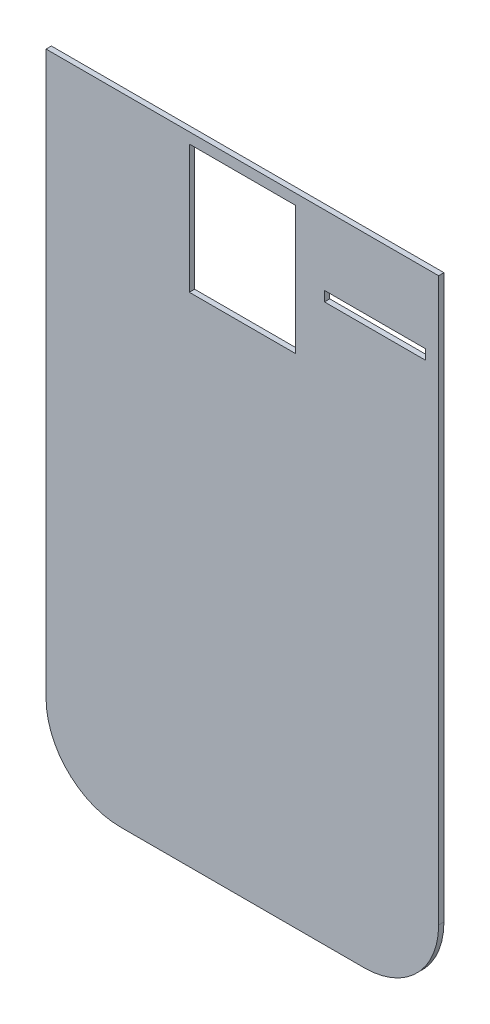
ISO-10303-21;
HEADER;
FILE_DESCRIPTION(('STEP AP214'),'2;1');
FILE_NAME('part.step','',(''),(''),'','','');
FILE_SCHEMA(('AUTOMOTIVE_DESIGN { 1 0 10303 214 1 1 1 1 }'));
ENDSEC;
DATA;
#1=APPLICATION_CONTEXT('core data for automotive mechanical design processes');
#2=APPLICATION_PROTOCOL_DEFINITION('international standard','automotive_design',2000,#1);
#3=PRODUCT_CONTEXT('',#1,'mechanical');
#4=PRODUCT('Part','Part','',(#3));
#5=PRODUCT_RELATED_PRODUCT_CATEGORY('part','',(#4));
#6=PRODUCT_DEFINITION_FORMATION('','',#4);
#7=PRODUCT_DEFINITION_CONTEXT('part definition',#1,'design');
#8=PRODUCT_DEFINITION('design','',#6,#7);
#9=PRODUCT_DEFINITION_SHAPE('','',#8);
#10=(LENGTH_UNIT() NAMED_UNIT(*) SI_UNIT(.MILLI.,.METRE.));
#11=(NAMED_UNIT(*) PLANE_ANGLE_UNIT() SI_UNIT($,.RADIAN.));
#12=(NAMED_UNIT(*) SI_UNIT($,.STERADIAN.) SOLID_ANGLE_UNIT());
#13=UNCERTAINTY_MEASURE_WITH_UNIT(LENGTH_MEASURE(1.E-05),#10,'distance_accuracy_value','');
#14=(GEOMETRIC_REPRESENTATION_CONTEXT(3) GLOBAL_UNCERTAINTY_ASSIGNED_CONTEXT((#13)) GLOBAL_UNIT_ASSIGNED_CONTEXT((#10,
#11,#12)) REPRESENTATION_CONTEXT('',''));
#15=CARTESIAN_POINT('',(0.,0.,0.));
#16=DIRECTION('',(0.,0.,1.));
#17=DIRECTION('',(1.,0.,0.));
#18=AXIS2_PLACEMENT_3D('',#15,#16,#17);
#19=CARTESIAN_POINT('',(400.,0.,350.));
#20=DIRECTION('',(0.,0.,-1.));
#21=DIRECTION('',(0.,1.,0.));
#22=AXIS2_PLACEMENT_3D('',#19,#20,#21);
#23=PLANE('',#22);
#24=DIRECTION('',(-1.,0.,0.));
#25=VECTOR('',#24,1.);
#26=CARTESIAN_POINT('',(372.65,794.2,350.));
#27=LINE('',#26,#25);
#28=CARTESIAN_POINT('',(372.65,794.2,350.));
#29=VERTEX_POINT('',#28);
#30=CARTESIAN_POINT('',(277.35,794.2,350.));
#31=VERTEX_POINT('',#30);
#32=EDGE_CURVE('E195',#29,#31,#27,.T.);
#33=ORIENTED_EDGE('',*,*,#32,.F.);
#34=DIRECTION('',(0.,1.,0.));
#35=VECTOR('',#34,1.);
#36=CARTESIAN_POINT('',(372.65,794.2,350.));
#37=LINE('',#36,#35);
#38=CARTESIAN_POINT('',(372.65,784.8,350.));
#39=VERTEX_POINT('',#38);
#40=EDGE_CURVE('E192',#39,#29,#37,.T.);
#41=ORIENTED_EDGE('',*,*,#40,.F.);
#42=DIRECTION('',(1.,0.,0.));
#43=VECTOR('',#42,1.);
#44=CARTESIAN_POINT('',(372.65,784.8,350.));
#45=LINE('',#44,#43);
#46=CARTESIAN_POINT('',(277.35,784.800000000001,350.));
#47=VERTEX_POINT('',#46);
#48=EDGE_CURVE('E201',#47,#39,#45,.T.);
#49=ORIENTED_EDGE('',*,*,#48,.F.);
#50=DIRECTION('',(0.,-1.,0.));
#51=VECTOR('',#50,1.);
#52=CARTESIAN_POINT('',(277.35,794.2,350.));
#53=LINE('',#52,#51);
#54=EDGE_CURVE('E198',#31,#47,#53,.T.);
#55=ORIENTED_EDGE('',*,*,#54,.F.);
#56=EDGE_LOOP('',(#33,#41,#49,#55));
#57=FACE_BOUND('',#56,.T.);
#58=DIRECTION('',(1.,0.,0.));
#59=VECTOR('',#58,1.);
#60=CARTESIAN_POINT('',(150.,729.,350.));
#61=LINE('',#60,#59);
#62=CARTESIAN_POINT('',(150.,729.,350.));
#63=VERTEX_POINT('',#62);
#64=CARTESIAN_POINT('',(250.,729.,350.));
#65=VERTEX_POINT('',#64);
#66=EDGE_CURVE('E215',#63,#65,#61,.T.);
#67=ORIENTED_EDGE('',*,*,#66,.F.);
#68=DIRECTION('',(0.,-1.,0.));
#69=VECTOR('',#68,1.);
#70=CARTESIAN_POINT('',(150.,850.,350.));
#71=LINE('',#70,#69);
#72=CARTESIAN_POINT('',(150.,850.,350.));
#73=VERTEX_POINT('',#72);
#74=EDGE_CURVE('E207',#73,#63,#71,.T.);
#75=ORIENTED_EDGE('',*,*,#74,.F.);
#76=DIRECTION('',(-1.,0.,0.));
#77=VECTOR('',#76,1.);
#78=CARTESIAN_POINT('',(150.,850.,350.));
#79=LINE('',#78,#77);
#80=CARTESIAN_POINT('',(250.,850.,350.));
#81=VERTEX_POINT('',#80);
#82=EDGE_CURVE('E221',#81,#73,#79,.T.);
#83=ORIENTED_EDGE('',*,*,#82,.F.);
#84=DIRECTION('',(0.,1.,0.));
#85=VECTOR('',#84,1.);
#86=CARTESIAN_POINT('',(250.,850.,350.));
#87=LINE('',#86,#85);
#88=EDGE_CURVE('E218',#65,#81,#87,.T.);
#89=ORIENTED_EDGE('',*,*,#88,.F.);
#90=EDGE_LOOP('',(#67,#75,#83,#89));
#91=FACE_BOUND('',#90,.T.);
#92=DIRECTION('',(-1.,0.,0.));
#93=VECTOR('',#92,1.);
#94=CARTESIAN_POINT('',(400.,860.,350.));
#95=LINE('',#94,#93);
#96=CARTESIAN_POINT('',(385.,860.,350.));
#97=VERTEX_POINT('',#96);
#98=CARTESIAN_POINT('',(15.,860.,350.));
#99=VERTEX_POINT('',#98);
#100=EDGE_CURVE('E227',#97,#99,#95,.T.);
#101=ORIENTED_EDGE('',*,*,#100,.T.);
#102=DIRECTION('',(0.,1.,0.));
#103=VECTOR('',#102,1.);
#104=CARTESIAN_POINT('',(15.,917.971493867901,350.));
#105=LINE('',#104,#103);
#106=CARTESIAN_POINT('',(15.,330.,350.));
#107=VERTEX_POINT('',#106);
#108=EDGE_CURVE('E141',#107,#99,#105,.T.);
#109=ORIENTED_EDGE('',*,*,#108,.F.);
#110=CARTESIAN_POINT('',(85.,330.,350.));
#111=DIRECTION('',(0.,0.,-1.));
#112=DIRECTION('',(1.,0.,0.));
#113=AXIS2_PLACEMENT_3D('',#110,#111,#112);
#114=CIRCLE('',#113,70.);
#115=CARTESIAN_POINT('',(85.,260.,350.));
#116=VERTEX_POINT('',#115);
#117=EDGE_CURVE('E156',#116,#107,#114,.T.);
#118=ORIENTED_EDGE('',*,*,#117,.F.);
#119=DIRECTION('',(-1.,0.,0.));
#120=VECTOR('',#119,1.);
#121=CARTESIAN_POINT('',(85.,260.,350.));
#122=LINE('',#121,#120);
#123=CARTESIAN_POINT('',(315.,260.,350.));
#124=VERTEX_POINT('',#123);
#125=EDGE_CURVE('E154',#124,#116,#122,.T.);
#126=ORIENTED_EDGE('',*,*,#125,.F.);
#127=CARTESIAN_POINT('',(315.,330.,350.));
#128=DIRECTION('',(0.,0.,-1.));
#129=DIRECTION('',(1.,0.,0.));
#130=AXIS2_PLACEMENT_3D('',#127,#128,#129);
#131=CIRCLE('',#130,70.);
#132=CARTESIAN_POINT('',(385.,330.,350.));
#133=VERTEX_POINT('',#132);
#134=EDGE_CURVE('E135',#133,#124,#131,.T.);
#135=ORIENTED_EDGE('',*,*,#134,.F.);
#136=DIRECTION('',(0.,-1.,0.));
#137=VECTOR('',#136,1.);
#138=CARTESIAN_POINT('',(385.,330.,350.));
#139=LINE('',#138,#137);
#140=EDGE_CURVE('E144',#97,#133,#139,.T.);
#141=ORIENTED_EDGE('',*,*,#140,.F.);
#142=EDGE_LOOP('',(#101,#109,#118,#126,#135,#141));
#143=FACE_BOUND('',#142,.T.);
#144=ADVANCED_FACE('F33',(#57,#91,#143),#23,.F.);
#145=CARTESIAN_POINT('',(150.,850.,81.9999999999999));
#146=DIRECTION('',(-1.,0.,0.));
#147=DIRECTION('',(0.,-1.,0.));
#148=AXIS2_PLACEMENT_3D('',#145,#146,#147);
#149=PLANE('',#148);
#150=DIRECTION('',(0.,0.,1.));
#151=VECTOR('',#150,1.);
#152=CARTESIAN_POINT('',(150.,729.,81.9999999999999));
#153=LINE('',#152,#151);
#154=CARTESIAN_POINT('',(150.,729.,345.));
#155=VERTEX_POINT('',#154);
#156=EDGE_CURVE('E224',#155,#63,#153,.T.);
#157=ORIENTED_EDGE('',*,*,#156,.F.);
#158=DIRECTION('',(0.,1.,0.));
#159=VECTOR('',#158,1.);
#160=CARTESIAN_POINT('',(150.,850.,345.));
#161=LINE('',#160,#159);
#162=CARTESIAN_POINT('',(150.,850.,345.));
#163=VERTEX_POINT('',#162);
#164=EDGE_CURVE('E55',#155,#163,#161,.T.);
#165=ORIENTED_EDGE('',*,*,#164,.T.);
#166=DIRECTION('',(0.,0.,1.));
#167=VECTOR('',#166,1.);
#168=CARTESIAN_POINT('',(150.,850.,81.9999999999999));
#169=LINE('',#168,#167);
#170=EDGE_CURVE('E225',#163,#73,#169,.T.);
#171=ORIENTED_EDGE('',*,*,#170,.T.);
#172=ORIENTED_EDGE('',*,*,#74,.T.);
#173=EDGE_LOOP('',(#157,#165,#171,#172));
#174=FACE_BOUND('',#173,.T.);
#175=ADVANCED_FACE('F271',(#174),#149,.F.);
#176=CARTESIAN_POINT('',(150.,850.,81.9999999999999));
#177=DIRECTION('',(0.,1.,0.));
#178=DIRECTION('',(0.,0.,1.));
#179=AXIS2_PLACEMENT_3D('',#176,#177,#178);
#180=PLANE('',#179);
#181=ORIENTED_EDGE('',*,*,#170,.F.);
#182=DIRECTION('',(1.,0.,0.));
#183=VECTOR('',#182,1.);
#184=CARTESIAN_POINT('',(150.,850.,345.));
#185=LINE('',#184,#183);
#186=CARTESIAN_POINT('',(250.,850.,345.));
#187=VERTEX_POINT('',#186);
#188=EDGE_CURVE('E188',#163,#187,#185,.T.);
#189=ORIENTED_EDGE('',*,*,#188,.T.);
#190=DIRECTION('',(0.,0.,1.));
#191=VECTOR('',#190,1.);
#192=CARTESIAN_POINT('',(250.,850.,81.9999999999999));
#193=LINE('',#192,#191);
#194=EDGE_CURVE('E228',#187,#81,#193,.T.);
#195=ORIENTED_EDGE('',*,*,#194,.T.);
#196=ORIENTED_EDGE('',*,*,#82,.T.);
#197=EDGE_LOOP('',(#181,#189,#195,#196));
#198=FACE_BOUND('',#197,.T.);
#199=ADVANCED_FACE('F276',(#198),#180,.F.);
#200=CARTESIAN_POINT('',(250.,850.,81.9999999999999));
#201=DIRECTION('',(1.,0.,0.));
#202=DIRECTION('',(0.,0.,-1.));
#203=AXIS2_PLACEMENT_3D('',#200,#201,#202);
#204=PLANE('',#203);
#205=ORIENTED_EDGE('',*,*,#194,.F.);
#206=DIRECTION('',(0.,-1.,0.));
#207=VECTOR('',#206,1.);
#208=CARTESIAN_POINT('',(250.,850.,345.));
#209=LINE('',#208,#207);
#210=CARTESIAN_POINT('',(250.,729.,345.));
#211=VERTEX_POINT('',#210);
#212=EDGE_CURVE('E185',#187,#211,#209,.T.);
#213=ORIENTED_EDGE('',*,*,#212,.T.);
#214=DIRECTION('',(0.,0.,1.));
#215=VECTOR('',#214,1.);
#216=CARTESIAN_POINT('',(250.,729.,81.9999999999999));
#217=LINE('',#216,#215);
#218=EDGE_CURVE('E230',#211,#65,#217,.T.);
#219=ORIENTED_EDGE('',*,*,#218,.T.);
#220=ORIENTED_EDGE('',*,*,#88,.T.);
#221=EDGE_LOOP('',(#205,#213,#219,#220));
#222=FACE_BOUND('',#221,.T.);
#223=ADVANCED_FACE('F294',(#222),#204,.F.);
#224=CARTESIAN_POINT('',(150.,729.,81.9999999999999));
#225=DIRECTION('',(0.,-1.,0.));
#226=DIRECTION('',(0.,0.,-1.));
#227=AXIS2_PLACEMENT_3D('',#224,#225,#226);
#228=PLANE('',#227);
#229=ORIENTED_EDGE('',*,*,#218,.F.);
#230=DIRECTION('',(-1.,0.,0.));
#231=VECTOR('',#230,1.);
#232=CARTESIAN_POINT('',(150.,729.,345.));
#233=LINE('',#232,#231);
#234=EDGE_CURVE('E183',#211,#155,#233,.T.);
#235=ORIENTED_EDGE('',*,*,#234,.T.);
#236=ORIENTED_EDGE('',*,*,#156,.T.);
#237=ORIENTED_EDGE('',*,*,#66,.T.);
#238=EDGE_LOOP('',(#229,#235,#236,#237));
#239=FACE_BOUND('',#238,.T.);
#240=ADVANCED_FACE('F288',(#239),#228,.F.);
#241=CARTESIAN_POINT('',(372.65,794.2,81.9999999999999));
#242=DIRECTION('',(1.,0.,0.));
#243=DIRECTION('',(0.,0.,-1.));
#244=AXIS2_PLACEMENT_3D('',#241,#242,#243);
#245=PLANE('',#244);
#246=DIRECTION('',(0.,0.,1.));
#247=VECTOR('',#246,1.);
#248=CARTESIAN_POINT('',(372.65,794.2,81.9999999999999));
#249=LINE('',#248,#247);
#250=CARTESIAN_POINT('',(372.65,794.2,345.));
#251=VERTEX_POINT('',#250);
#252=EDGE_CURVE('E204',#251,#29,#249,.T.);
#253=ORIENTED_EDGE('',*,*,#252,.F.);
#254=DIRECTION('',(0.,-1.,0.));
#255=VECTOR('',#254,1.);
#256=CARTESIAN_POINT('',(372.65,794.2,345.));
#257=LINE('',#256,#255);
#258=CARTESIAN_POINT('',(372.65,784.8,345.));
#259=VERTEX_POINT('',#258);
#260=EDGE_CURVE('E180',#251,#259,#257,.T.);
#261=ORIENTED_EDGE('',*,*,#260,.T.);
#262=DIRECTION('',(0.,0.,1.));
#263=VECTOR('',#262,1.);
#264=CARTESIAN_POINT('',(372.65,784.8,81.9999999999999));
#265=LINE('',#264,#263);
#266=EDGE_CURVE('E205',#259,#39,#265,.T.);
#267=ORIENTED_EDGE('',*,*,#266,.T.);
#268=ORIENTED_EDGE('',*,*,#40,.T.);
#269=EDGE_LOOP('',(#253,#261,#267,#268));
#270=FACE_BOUND('',#269,.T.);
#271=ADVANCED_FACE('F301',(#270),#245,.F.);
#272=CARTESIAN_POINT('',(372.65,784.8,81.9999999999999));
#273=DIRECTION('',(0.,-1.,0.));
#274=DIRECTION('',(1.,0.,0.));
#275=AXIS2_PLACEMENT_3D('',#272,#273,#274);
#276=PLANE('',#275);
#277=ORIENTED_EDGE('',*,*,#266,.F.);
#278=DIRECTION('',(-1.,0.,0.));
#279=VECTOR('',#278,1.);
#280=CARTESIAN_POINT('',(372.65,784.8,345.));
#281=LINE('',#280,#279);
#282=CARTESIAN_POINT('',(277.35,784.800000000001,345.));
#283=VERTEX_POINT('',#282);
#284=EDGE_CURVE('E177',#259,#283,#281,.T.);
#285=ORIENTED_EDGE('',*,*,#284,.T.);
#286=DIRECTION('',(0.,0.,1.));
#287=VECTOR('',#286,1.);
#288=CARTESIAN_POINT('',(277.35,784.800000000001,81.9999999999999));
#289=LINE('',#288,#287);
#290=EDGE_CURVE('E208',#283,#47,#289,.T.);
#291=ORIENTED_EDGE('',*,*,#290,.T.);
#292=ORIENTED_EDGE('',*,*,#48,.T.);
#293=EDGE_LOOP('',(#277,#285,#291,#292));
#294=FACE_BOUND('',#293,.T.);
#295=ADVANCED_FACE('F306',(#294),#276,.F.);
#296=CARTESIAN_POINT('',(277.35,794.2,81.9999999999999));
#297=DIRECTION('',(-1.,0.,0.));
#298=DIRECTION('',(0.,0.,1.));
#299=AXIS2_PLACEMENT_3D('',#296,#297,#298);
#300=PLANE('',#299);
#301=ORIENTED_EDGE('',*,*,#290,.F.);
#302=DIRECTION('',(0.,1.,0.));
#303=VECTOR('',#302,1.);
#304=CARTESIAN_POINT('',(277.35,794.2,345.));
#305=LINE('',#304,#303);
#306=CARTESIAN_POINT('',(277.35,794.2,345.));
#307=VERTEX_POINT('',#306);
#308=EDGE_CURVE('E174',#283,#307,#305,.T.);
#309=ORIENTED_EDGE('',*,*,#308,.T.);
#310=DIRECTION('',(0.,0.,1.));
#311=VECTOR('',#310,1.);
#312=CARTESIAN_POINT('',(277.35,794.2,81.9999999999999));
#313=LINE('',#312,#311);
#314=EDGE_CURVE('E210',#307,#31,#313,.T.);
#315=ORIENTED_EDGE('',*,*,#314,.T.);
#316=ORIENTED_EDGE('',*,*,#54,.T.);
#317=EDGE_LOOP('',(#301,#309,#315,#316));
#318=FACE_BOUND('',#317,.T.);
#319=ADVANCED_FACE('F266',(#318),#300,.F.);
#320=CARTESIAN_POINT('',(372.65,794.2,81.9999999999999));
#321=DIRECTION('',(0.,1.,0.));
#322=DIRECTION('',(-1.,0.,0.));
#323=AXIS2_PLACEMENT_3D('',#320,#321,#322);
#324=PLANE('',#323);
#325=ORIENTED_EDGE('',*,*,#314,.F.);
#326=DIRECTION('',(1.,0.,0.));
#327=VECTOR('',#326,1.);
#328=CARTESIAN_POINT('',(372.65,794.2,345.));
#329=LINE('',#328,#327);
#330=EDGE_CURVE('E234',#307,#251,#329,.T.);
#331=ORIENTED_EDGE('',*,*,#330,.T.);
#332=ORIENTED_EDGE('',*,*,#252,.T.);
#333=ORIENTED_EDGE('',*,*,#32,.T.);
#334=EDGE_LOOP('',(#325,#331,#332,#333));
#335=FACE_BOUND('',#334,.T.);
#336=ADVANCED_FACE('F258',(#335),#324,.F.);
#337=CARTESIAN_POINT('',(574.,860.,350.));
#338=DIRECTION('',(0.,-1.,0.));
#339=DIRECTION('',(0.,0.,-1.));
#340=AXIS2_PLACEMENT_3D('',#337,#338,#339);
#341=PLANE('',#340);
#342=DIRECTION('',(-1.,0.,0.));
#343=VECTOR('',#342,1.);
#344=CARTESIAN_POINT('',(574.,860.,345.));
#345=LINE('',#344,#343);
#346=CARTESIAN_POINT('',(385.,860.,345.));
#347=VERTEX_POINT('',#346);
#348=CARTESIAN_POINT('',(15.,860.,345.));
#349=VERTEX_POINT('',#348);
#350=EDGE_CURVE('E171',#347,#349,#345,.T.);
#351=ORIENTED_EDGE('',*,*,#350,.T.);
#352=DIRECTION('',(0.,0.,1.));
#353=VECTOR('',#352,1.);
#354=CARTESIAN_POINT('',(15.,860.,350.));
#355=LINE('',#354,#353);
#356=EDGE_CURVE('E168',#349,#99,#355,.T.);
#357=ORIENTED_EDGE('',*,*,#356,.T.);
#358=ORIENTED_EDGE('',*,*,#100,.F.);
#359=DIRECTION('',(0.,0.,-1.));
#360=VECTOR('',#359,1.);
#361=CARTESIAN_POINT('',(385.,860.,350.));
#362=LINE('',#361,#360);
#363=EDGE_CURVE('E147',#97,#347,#362,.T.);
#364=ORIENTED_EDGE('',*,*,#363,.T.);
#365=EDGE_LOOP('',(#351,#357,#358,#364));
#366=FACE_BOUND('',#365,.T.);
#367=ADVANCED_FACE('F256',(#366),#341,.F.);
#368=CARTESIAN_POINT('',(574.,860.,345.));
#369=DIRECTION('',(0.,0.,1.));
#370=DIRECTION('',(0.,-1.,0.));
#371=AXIS2_PLACEMENT_3D('',#368,#369,#370);
#372=PLANE('',#371);
#373=ORIENTED_EDGE('',*,*,#330,.F.);
#374=ORIENTED_EDGE('',*,*,#308,.F.);
#375=ORIENTED_EDGE('',*,*,#284,.F.);
#376=ORIENTED_EDGE('',*,*,#260,.F.);
#377=EDGE_LOOP('',(#373,#374,#375,#376));
#378=FACE_BOUND('',#377,.T.);
#379=ORIENTED_EDGE('',*,*,#234,.F.);
#380=ORIENTED_EDGE('',*,*,#212,.F.);
#381=ORIENTED_EDGE('',*,*,#188,.F.);
#382=ORIENTED_EDGE('',*,*,#164,.F.);
#383=EDGE_LOOP('',(#379,#380,#381,#382));
#384=FACE_BOUND('',#383,.T.);
#385=CARTESIAN_POINT('',(85.,330.,345.));
#386=DIRECTION('',(0.,0.,1.));
#387=DIRECTION('',(0.,-1.,0.));
#388=AXIS2_PLACEMENT_3D('',#385,#386,#387);
#389=CIRCLE('',#388,70.);
#390=CARTESIAN_POINT('',(85.,260.,345.));
#391=VERTEX_POINT('',#390);
#392=CARTESIAN_POINT('',(15.,330.,345.));
#393=VERTEX_POINT('',#392);
#394=EDGE_CURVE('E40',#391,#393,#389,.F.);
#395=ORIENTED_EDGE('',*,*,#394,.T.);
#396=DIRECTION('',(0.,1.,0.));
#397=VECTOR('',#396,1.);
#398=CARTESIAN_POINT('',(15.,860.,345.));
#399=LINE('',#398,#397);
#400=EDGE_CURVE('E11',#393,#349,#399,.T.);
#401=ORIENTED_EDGE('',*,*,#400,.T.);
#402=ORIENTED_EDGE('',*,*,#350,.F.);
#403=DIRECTION('',(0.,-1.,0.));
#404=VECTOR('',#403,1.);
#405=CARTESIAN_POINT('',(385.,860.,345.));
#406=LINE('',#405,#404);
#407=CARTESIAN_POINT('',(385.,330.,345.));
#408=VERTEX_POINT('',#407);
#409=EDGE_CURVE('E237',#347,#408,#406,.T.);
#410=ORIENTED_EDGE('',*,*,#409,.T.);
#411=CARTESIAN_POINT('',(315.,330.,345.));
#412=DIRECTION('',(0.,0.,1.));
#413=DIRECTION('',(0.,-1.,0.));
#414=AXIS2_PLACEMENT_3D('',#411,#412,#413);
#415=CIRCLE('',#414,70.);
#416=CARTESIAN_POINT('',(315.,260.,345.));
#417=VERTEX_POINT('',#416);
#418=EDGE_CURVE('E138',#408,#417,#415,.F.);
#419=ORIENTED_EDGE('',*,*,#418,.T.);
#420=DIRECTION('',(-1.,0.,0.));
#421=VECTOR('',#420,1.);
#422=CARTESIAN_POINT('',(574.,260.,345.));
#423=LINE('',#422,#421);
#424=EDGE_CURVE('E240',#417,#391,#423,.T.);
#425=ORIENTED_EDGE('',*,*,#424,.T.);
#426=EDGE_LOOP('',(#395,#401,#402,#410,#419,#425));
#427=FACE_BOUND('',#426,.T.);
#428=ADVANCED_FACE('F244',(#378,#384,#427),#372,.F.);
#429=CARTESIAN_POINT('',(15.,917.971493867901,-224.));
#430=DIRECTION('',(1.,0.,0.));
#431=DIRECTION('',(0.,0.,-1.));
#432=AXIS2_PLACEMENT_3D('',#429,#430,#431);
#433=PLANE('',#432);
#434=ORIENTED_EDGE('',*,*,#400,.F.);
#435=DIRECTION('',(0.,0.,1.));
#436=VECTOR('',#435,1.);
#437=CARTESIAN_POINT('',(15.,330.,-224.));
#438=LINE('',#437,#436);
#439=EDGE_CURVE('E162',#393,#107,#438,.T.);
#440=ORIENTED_EDGE('',*,*,#439,.T.);
#441=ORIENTED_EDGE('',*,*,#108,.T.);
#442=ORIENTED_EDGE('',*,*,#356,.F.);
#443=EDGE_LOOP('',(#434,#440,#441,#442));
#444=FACE_BOUND('',#443,.T.);
#445=ADVANCED_FACE('F254',(#444),#433,.F.);
#446=CARTESIAN_POINT('',(85.,330.,-224.));
#447=DIRECTION('',(0.,0.,1.));
#448=DIRECTION('',(1.,0.,0.));
#449=AXIS2_PLACEMENT_3D('',#446,#447,#448);
#450=CYLINDRICAL_SURFACE('',#449,70.);
#451=DIRECTION('',(0.,0.,1.));
#452=VECTOR('',#451,1.);
#453=CARTESIAN_POINT('',(85.,260.,-224.));
#454=LINE('',#453,#452);
#455=EDGE_CURVE('E164',#391,#116,#454,.T.);
#456=ORIENTED_EDGE('',*,*,#455,.T.);
#457=ORIENTED_EDGE('',*,*,#117,.T.);
#458=ORIENTED_EDGE('',*,*,#439,.F.);
#459=ORIENTED_EDGE('',*,*,#394,.F.);
#460=EDGE_LOOP('',(#456,#457,#458,#459));
#461=FACE_BOUND('',#460,.T.);
#462=ADVANCED_FACE('F249',(#461),#450,.T.);
#463=CARTESIAN_POINT('',(85.,260.,-224.));
#464=DIRECTION('',(0.,1.,0.));
#465=DIRECTION('',(0.,0.,1.));
#466=AXIS2_PLACEMENT_3D('',#463,#464,#465);
#467=PLANE('',#466);
#468=DIRECTION('',(0.,0.,1.));
#469=VECTOR('',#468,1.);
#470=CARTESIAN_POINT('',(315.,260.,-224.));
#471=LINE('',#470,#469);
#472=EDGE_CURVE('E140',#417,#124,#471,.T.);
#473=ORIENTED_EDGE('',*,*,#472,.T.);
#474=ORIENTED_EDGE('',*,*,#125,.T.);
#475=ORIENTED_EDGE('',*,*,#455,.F.);
#476=ORIENTED_EDGE('',*,*,#424,.F.);
#477=EDGE_LOOP('',(#473,#474,#475,#476));
#478=FACE_BOUND('',#477,.T.);
#479=ADVANCED_FACE('F251',(#478),#467,.F.);
#480=CARTESIAN_POINT('',(315.,330.,-224.));
#481=DIRECTION('',(0.,0.,1.));
#482=DIRECTION('',(1.,0.,0.));
#483=AXIS2_PLACEMENT_3D('',#480,#481,#482);
#484=CYLINDRICAL_SURFACE('',#483,70.);
#485=DIRECTION('',(0.,0.,1.));
#486=VECTOR('',#485,1.);
#487=CARTESIAN_POINT('',(385.,330.,-224.));
#488=LINE('',#487,#486);
#489=EDGE_CURVE('E47',#408,#133,#488,.T.);
#490=ORIENTED_EDGE('',*,*,#489,.T.);
#491=ORIENTED_EDGE('',*,*,#134,.T.);
#492=ORIENTED_EDGE('',*,*,#472,.F.);
#493=ORIENTED_EDGE('',*,*,#418,.F.);
#494=EDGE_LOOP('',(#490,#491,#492,#493));
#495=FACE_BOUND('',#494,.T.);
#496=ADVANCED_FACE('F132',(#495),#484,.T.);
#497=CARTESIAN_POINT('',(385.,330.,-224.));
#498=DIRECTION('',(-1.,0.,0.));
#499=DIRECTION('',(0.,0.,1.));
#500=AXIS2_PLACEMENT_3D('',#497,#498,#499);
#501=PLANE('',#500);
#502=ORIENTED_EDGE('',*,*,#140,.T.);
#503=ORIENTED_EDGE('',*,*,#489,.F.);
#504=ORIENTED_EDGE('',*,*,#409,.F.);
#505=ORIENTED_EDGE('',*,*,#363,.F.);
#506=EDGE_LOOP('',(#502,#503,#504,#505));
#507=FACE_BOUND('',#506,.T.);
#508=ADVANCED_FACE('F145',(#507),#501,.F.);
#509=CLOSED_SHELL('',(#144,#175,#199,#223,#240,#271,#295,#319,#336,#367,#428,#445,#462,#479,
#496,#508));
#510=MANIFOLD_SOLID_BREP('B2',#509);
#511=ADVANCED_BREP_SHAPE_REPRESENTATION('',(#18,#510),#14);
#512=SHAPE_DEFINITION_REPRESENTATION(#9,#511);
ENDSEC;
END-ISO-10303-21;
